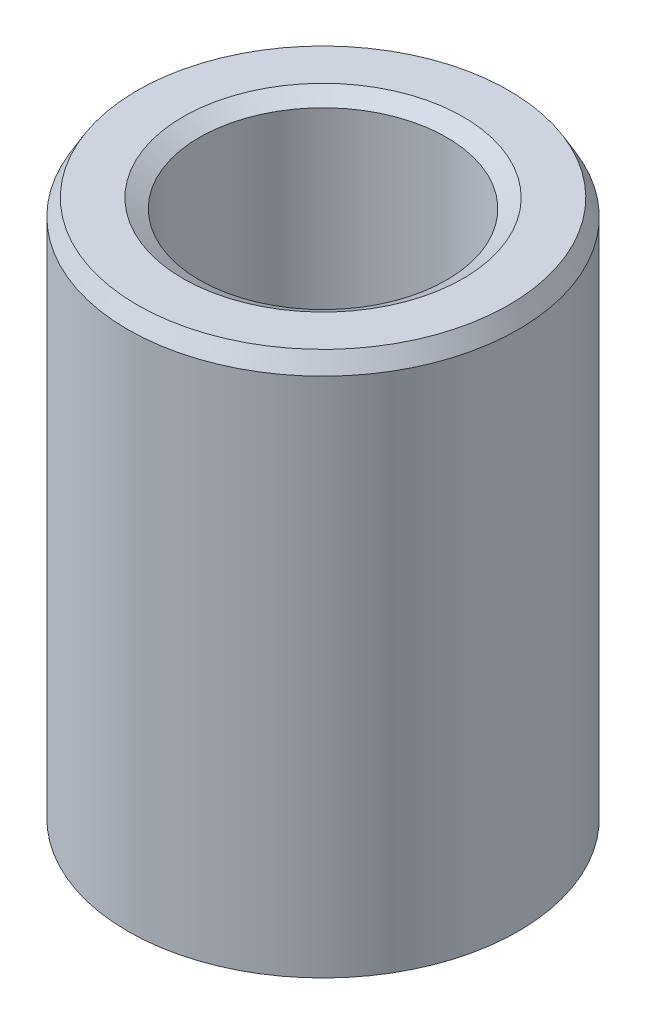
ISO-10303-21;
HEADER;
FILE_DESCRIPTION(('STEP AP214'),'2;1');
FILE_NAME('part.step','',(''),(''),'','','');
FILE_SCHEMA(('AUTOMOTIVE_DESIGN { 1 0 10303 214 1 1 1 1 }'));
ENDSEC;
DATA;
#1=APPLICATION_CONTEXT('core data for automotive mechanical design processes');
#2=APPLICATION_PROTOCOL_DEFINITION('international standard','automotive_design',2000,#1);
#3=PRODUCT_CONTEXT('',#1,'mechanical');
#4=PRODUCT('Part','Part','',(#3));
#5=PRODUCT_RELATED_PRODUCT_CATEGORY('part','',(#4));
#6=PRODUCT_DEFINITION_FORMATION('','',#4);
#7=PRODUCT_DEFINITION_CONTEXT('part definition',#1,'design');
#8=PRODUCT_DEFINITION('design','',#6,#7);
#9=PRODUCT_DEFINITION_SHAPE('','',#8);
#10=(LENGTH_UNIT() NAMED_UNIT(*) SI_UNIT(.MILLI.,.METRE.));
#11=(NAMED_UNIT(*) PLANE_ANGLE_UNIT() SI_UNIT($,.RADIAN.));
#12=(NAMED_UNIT(*) SI_UNIT($,.STERADIAN.) SOLID_ANGLE_UNIT());
#13=UNCERTAINTY_MEASURE_WITH_UNIT(LENGTH_MEASURE(1.E-05),#10,'distance_accuracy_value','');
#14=(GEOMETRIC_REPRESENTATION_CONTEXT(3) GLOBAL_UNCERTAINTY_ASSIGNED_CONTEXT((#13)) GLOBAL_UNIT_ASSIGNED_CONTEXT((#10,
#11,#12)) REPRESENTATION_CONTEXT('',''));
#15=CARTESIAN_POINT('',(0.,0.,0.));
#16=DIRECTION('',(0.,0.,1.));
#17=DIRECTION('',(1.,0.,0.));
#18=AXIS2_PLACEMENT_3D('',#15,#16,#17);
#19=CARTESIAN_POINT('',(0.,70.0365694800831,0.));
#20=DIRECTION('',(0.,-1.,0.));
#21=DIRECTION('',(0.,0.,-1.));
#22=AXIS2_PLACEMENT_3D('',#19,#20,#21);
#23=CYLINDRICAL_SURFACE('',#22,25.);
#24=CARTESIAN_POINT('',(0.,1.21935203861363,0.));
#25=DIRECTION('',(0.,1.,0.));
#26=DIRECTION('',(0.,0.,1.));
#27=AXIS2_PLACEMENT_3D('',#24,#25,#26);
#28=CIRCLE('',#27,25.);
#29=CARTESIAN_POINT('',(0.,1.21935203861363,25.));
#30=VERTEX_POINT('',#29);
#31=EDGE_CURVE('E10',#30,#30,#28,.T.);
#32=ORIENTED_EDGE('',*,*,#31,.T.);
#33=EDGE_LOOP('',(#32));
#34=FACE_BOUND('',#33,.T.);
#35=CARTESIAN_POINT('',(0.,67.9245897968916,0.));
#36=DIRECTION('',(0.,1.,0.));
#37=DIRECTION('',(0.,0.,1.));
#38=AXIS2_PLACEMENT_3D('',#35,#36,#37);
#39=CIRCLE('',#38,25.);
#40=CARTESIAN_POINT('',(0.,67.9245897968916,25.));
#41=VERTEX_POINT('',#40);
#42=EDGE_CURVE('E50',#41,#41,#39,.F.);
#43=ORIENTED_EDGE('',*,*,#42,.T.);
#44=EDGE_LOOP('',(#43));
#45=FACE_BOUND('',#44,.T.);
#46=ADVANCED_FACE('F39',(#34,#45),#23,.T.);
#47=CARTESIAN_POINT('',(0.,70.0365694800831,0.));
#48=DIRECTION('',(0.,1.,0.));
#49=DIRECTION('',(0.,0.,1.));
#50=AXIS2_PLACEMENT_3D('',#47,#48,#49);
#51=PLANE('',#50);
#52=CARTESIAN_POINT('',(0.,70.0365694800831,0.));
#53=DIRECTION('',(0.,1.,0.));
#54=DIRECTION('',(0.,0.,1.));
#55=AXIS2_PLACEMENT_3D('',#52,#53,#54);
#56=CIRCLE('',#55,17.9338804480547);
#57=CARTESIAN_POINT('',(0.,70.0365694800831,17.9338804480547));
#58=VERTEX_POINT('',#57);
#59=EDGE_CURVE('E58',#58,#58,#56,.F.);
#60=ORIENTED_EDGE('',*,*,#59,.T.);
#61=EDGE_LOOP('',(#60));
#62=FACE_BOUND('',#61,.T.);
#63=CARTESIAN_POINT('',(0.,70.0365694800831,0.));
#64=DIRECTION('',(0.,1.,0.));
#65=DIRECTION('',(0.,0.,1.));
#66=AXIS2_PLACEMENT_3D('',#63,#64,#65);
#67=CIRCLE('',#66,23.7806479613864);
#68=CARTESIAN_POINT('',(0.,70.0365694800831,23.7806479613864));
#69=VERTEX_POINT('',#68);
#70=EDGE_CURVE('E61',#69,#69,#67,.T.);
#71=ORIENTED_EDGE('',*,*,#70,.T.);
#72=EDGE_LOOP('',(#71));
#73=FACE_BOUND('',#72,.T.);
#74=ADVANCED_FACE('F88',(#62,#73),#51,.T.);
#75=CARTESIAN_POINT('',(0.,0.,0.));
#76=DIRECTION('',(0.,1.,0.));
#77=DIRECTION('',(0.,0.,1.));
#78=AXIS2_PLACEMENT_3D('',#75,#76,#77);
#79=PLANE('',#78);
#80=CARTESIAN_POINT('',(0.,0.,0.));
#81=DIRECTION('',(0.,1.,0.));
#82=DIRECTION('',(0.,0.,1.));
#83=AXIS2_PLACEMENT_3D('',#80,#81,#82);
#84=CIRCLE('',#83,17.0412528034769);
#85=CARTESIAN_POINT('',(0.,0.,17.0412528034769));
#86=VERTEX_POINT('',#85);
#87=EDGE_CURVE('E51',#86,#86,#84,.T.);
#88=ORIENTED_EDGE('',*,*,#87,.T.);
#89=EDGE_LOOP('',(#88));
#90=FACE_BOUND('',#89,.T.);
#91=CARTESIAN_POINT('',(0.,0.,0.));
#92=DIRECTION('',(0.,1.,0.));
#93=DIRECTION('',(0.,0.,1.));
#94=AXIS2_PLACEMENT_3D('',#91,#92,#93);
#95=CIRCLE('',#94,22.8880203168085);
#96=CARTESIAN_POINT('',(0.,0.,22.8880203168085));
#97=VERTEX_POINT('',#96);
#98=EDGE_CURVE('E54',#97,#97,#95,.F.);
#99=ORIENTED_EDGE('',*,*,#98,.T.);
#100=EDGE_LOOP('',(#99));
#101=FACE_BOUND('',#100,.T.);
#102=ADVANCED_FACE('F83',(#90,#101),#79,.F.);
#103=CARTESIAN_POINT('',(0.,70.0365694800831,0.));
#104=DIRECTION('',(0.,-1.,0.));
#105=DIRECTION('',(0.,0.,-1.));
#106=AXIS2_PLACEMENT_3D('',#103,#104,#105);
#107=CYLINDRICAL_SURFACE('',#106,15.8219007648632);
#108=CARTESIAN_POINT('',(0.,68.8172174414695,0.));
#109=DIRECTION('',(0.,1.,0.));
#110=DIRECTION('',(0.,0.,1.));
#111=AXIS2_PLACEMENT_3D('',#108,#109,#110);
#112=CIRCLE('',#111,15.8219007648632);
#113=CARTESIAN_POINT('',(0.,68.8172174414695,15.8219007648632));
#114=VERTEX_POINT('',#113);
#115=EDGE_CURVE('E67',#114,#114,#112,.T.);
#116=ORIENTED_EDGE('',*,*,#115,.T.);
#117=EDGE_LOOP('',(#116));
#118=FACE_BOUND('',#117,.T.);
#119=CARTESIAN_POINT('',(0.,2.11197968319149,0.));
#120=DIRECTION('',(0.,1.,0.));
#121=DIRECTION('',(0.,0.,1.));
#122=AXIS2_PLACEMENT_3D('',#119,#120,#121);
#123=CIRCLE('',#122,15.8219007648632);
#124=CARTESIAN_POINT('',(0.,2.11197968319149,15.8219007648632));
#125=VERTEX_POINT('',#124);
#126=EDGE_CURVE('E69',#125,#125,#123,.F.);
#127=ORIENTED_EDGE('',*,*,#126,.T.);
#128=EDGE_LOOP('',(#127));
#129=FACE_BOUND('',#128,.T.);
#130=ADVANCED_FACE('F71',(#118,#129),#107,.F.);
#131=CARTESIAN_POINT('',(0.,68.8172174414695,0.));
#132=DIRECTION('',(0.,1.,0.));
#133=DIRECTION('',(0.,0.,1.));
#134=AXIS2_PLACEMENT_3D('',#131,#132,#133);
#135=CONICAL_SURFACE('',#134,15.8219007648632,1.0471975511966);
#136=ORIENTED_EDGE('',*,*,#59,.F.);
#137=EDGE_LOOP('',(#136));
#138=FACE_BOUND('',#137,.T.);
#139=ORIENTED_EDGE('',*,*,#115,.F.);
#140=EDGE_LOOP('',(#139));
#141=FACE_BOUND('',#140,.T.);
#142=ADVANCED_FACE('F77',(#138,#141),#135,.F.);
#143=CARTESIAN_POINT('',(0.,0.,0.));
#144=DIRECTION('',(0.,-1.,0.));
#145=DIRECTION('',(0.,0.,-1.));
#146=AXIS2_PLACEMENT_3D('',#143,#144,#145);
#147=CONICAL_SURFACE('',#146,17.0412528034769,0.523598775598296);
#148=ORIENTED_EDGE('',*,*,#126,.F.);
#149=EDGE_LOOP('',(#148));
#150=FACE_BOUND('',#149,.T.);
#151=ORIENTED_EDGE('',*,*,#87,.F.);
#152=EDGE_LOOP('',(#151));
#153=FACE_BOUND('',#152,.T.);
#154=ADVANCED_FACE('F73',(#150,#153),#147,.F.);
#155=CARTESIAN_POINT('',(0.,1.21935203861363,0.));
#156=DIRECTION('',(0.,1.,0.));
#157=DIRECTION('',(0.,0.,1.));
#158=AXIS2_PLACEMENT_3D('',#155,#156,#157);
#159=CONICAL_SURFACE('',#158,25.,1.0471975511966);
#160=ORIENTED_EDGE('',*,*,#98,.F.);
#161=EDGE_LOOP('',(#160));
#162=FACE_BOUND('',#161,.T.);
#163=ORIENTED_EDGE('',*,*,#31,.F.);
#164=EDGE_LOOP('',(#163));
#165=FACE_BOUND('',#164,.T.);
#166=ADVANCED_FACE('F76',(#162,#165),#159,.T.);
#167=CARTESIAN_POINT('',(0.,70.0365694800831,0.));
#168=DIRECTION('',(0.,-1.,0.));
#169=DIRECTION('',(0.,0.,-1.));
#170=AXIS2_PLACEMENT_3D('',#167,#168,#169);
#171=CONICAL_SURFACE('',#170,23.7806479613864,0.523598775598295);
#172=ORIENTED_EDGE('',*,*,#42,.F.);
#173=EDGE_LOOP('',(#172));
#174=FACE_BOUND('',#173,.T.);
#175=ORIENTED_EDGE('',*,*,#70,.F.);
#176=EDGE_LOOP('',(#175));
#177=FACE_BOUND('',#176,.T.);
#178=ADVANCED_FACE('F45',(#174,#177),#171,.T.);
#179=CLOSED_SHELL('',(#46,#74,#102,#130,#142,#154,#166,#178));
#180=MANIFOLD_SOLID_BREP('B2',#179);
#181=ADVANCED_BREP_SHAPE_REPRESENTATION('',(#18,#180),#14);
#182=SHAPE_DEFINITION_REPRESENTATION(#9,#181);
ENDSEC;
END-ISO-10303-21;
